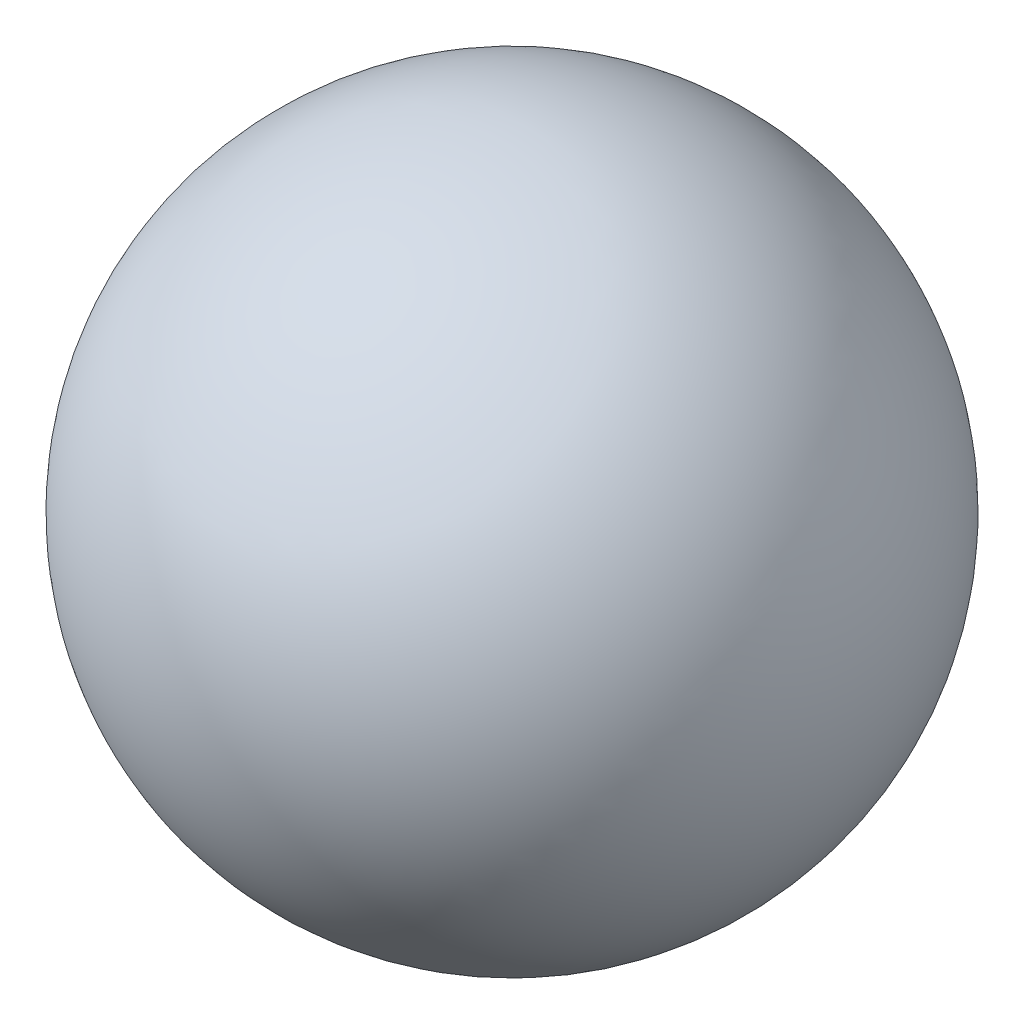
ISO-10303-21;
HEADER;
FILE_DESCRIPTION(('STEP AP214'),'2;1');
FILE_NAME('part.step','',(''),(''),'','','');
FILE_SCHEMA(('AUTOMOTIVE_DESIGN { 1 0 10303 214 1 1 1 1 }'));
ENDSEC;
DATA;
#1=APPLICATION_CONTEXT('core data for automotive mechanical design processes');
#2=APPLICATION_PROTOCOL_DEFINITION('international standard','automotive_design',2000,#1);
#3=PRODUCT_CONTEXT('',#1,'mechanical');
#4=PRODUCT('Part','Part','',(#3));
#5=PRODUCT_RELATED_PRODUCT_CATEGORY('part','',(#4));
#6=PRODUCT_DEFINITION_FORMATION('','',#4);
#7=PRODUCT_DEFINITION_CONTEXT('part definition',#1,'design');
#8=PRODUCT_DEFINITION('design','',#6,#7);
#9=PRODUCT_DEFINITION_SHAPE('','',#8);
#10=(LENGTH_UNIT() NAMED_UNIT(*) SI_UNIT(.MILLI.,.METRE.));
#11=(NAMED_UNIT(*) PLANE_ANGLE_UNIT() SI_UNIT($,.RADIAN.));
#12=(NAMED_UNIT(*) SI_UNIT($,.STERADIAN.) SOLID_ANGLE_UNIT());
#13=UNCERTAINTY_MEASURE_WITH_UNIT(LENGTH_MEASURE(1.E-05),#10,'distance_accuracy_value','');
#14=(GEOMETRIC_REPRESENTATION_CONTEXT(3) GLOBAL_UNCERTAINTY_ASSIGNED_CONTEXT((#13)) GLOBAL_UNIT_ASSIGNED_CONTEXT((#10,
#11,#12)) REPRESENTATION_CONTEXT('',''));
#15=CARTESIAN_POINT('',(0.,0.,0.));
#16=DIRECTION('',(0.,0.,1.));
#17=DIRECTION('',(1.,0.,0.));
#18=AXIS2_PLACEMENT_3D('',#15,#16,#17);
#19=CARTESIAN_POINT('',(11.1037596198974,-2.,-3.84304856897969));
#20=DIRECTION('',(0.,0.,1.));
#21=DIRECTION('',(1.,0.,0.));
#22=AXIS2_PLACEMENT_3D('',#19,#20,#21);
#23=SPHERICAL_SURFACE('',#22,1.05);
#24=CARTESIAN_POINT('',(11.1037596198974,-2.,-2.79304856897969));
#25=VERTEX_POINT('',#24);
#26=VERTEX_LOOP('',#25);
#27=FACE_BOUND('',#26,.T.);
#28=ADVANCED_FACE('F13',(#27),#23,.T.);
#29=CLOSED_SHELL('',(#28));
#30=MANIFOLD_SOLID_BREP('B1',#29);
#31=ADVANCED_BREP_SHAPE_REPRESENTATION('',(#18,#30),#14);
#32=SHAPE_DEFINITION_REPRESENTATION(#9,#31);
ENDSEC;
END-ISO-10303-21;
